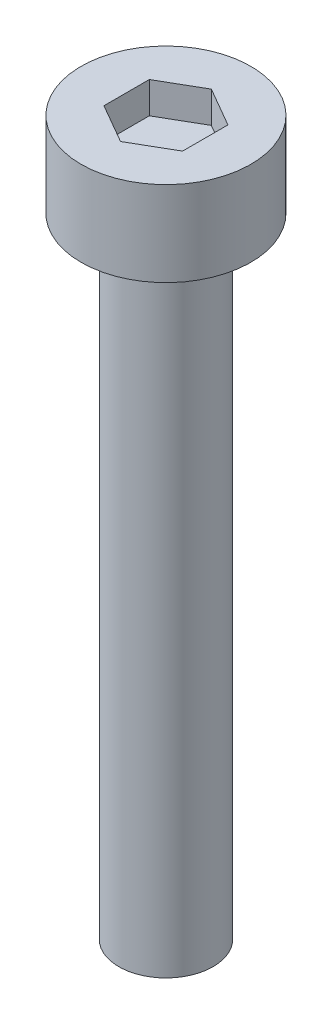
ISO-10303-21;
HEADER;
FILE_DESCRIPTION(('STEP AP214'),'2;1');
FILE_NAME('part.step','',(''),(''),'','','');
FILE_SCHEMA(('AUTOMOTIVE_DESIGN { 1 0 10303 214 1 1 1 1 }'));
ENDSEC;
DATA;
#1=APPLICATION_CONTEXT('core data for automotive mechanical design processes');
#2=APPLICATION_PROTOCOL_DEFINITION('international standard','automotive_design',2000,#1);
#3=PRODUCT_CONTEXT('',#1,'mechanical');
#4=PRODUCT('Part','Part','',(#3));
#5=PRODUCT_RELATED_PRODUCT_CATEGORY('part','',(#4));
#6=PRODUCT_DEFINITION_FORMATION('','',#4);
#7=PRODUCT_DEFINITION_CONTEXT('part definition',#1,'design');
#8=PRODUCT_DEFINITION('design','',#6,#7);
#9=PRODUCT_DEFINITION_SHAPE('','',#8);
#10=(LENGTH_UNIT() NAMED_UNIT(*) SI_UNIT(.MILLI.,.METRE.));
#11=(NAMED_UNIT(*) PLANE_ANGLE_UNIT() SI_UNIT($,.RADIAN.));
#12=(NAMED_UNIT(*) SI_UNIT($,.STERADIAN.) SOLID_ANGLE_UNIT());
#13=UNCERTAINTY_MEASURE_WITH_UNIT(LENGTH_MEASURE(1.E-05),#10,'distance_accuracy_value','');
#14=(GEOMETRIC_REPRESENTATION_CONTEXT(3) GLOBAL_UNCERTAINTY_ASSIGNED_CONTEXT((#13)) GLOBAL_UNIT_ASSIGNED_CONTEXT((#10,
#11,#12)) REPRESENTATION_CONTEXT('',''));
#15=CARTESIAN_POINT('',(0.,0.,0.));
#16=DIRECTION('',(0.,0.,1.));
#17=DIRECTION('',(1.,0.,0.));
#18=AXIS2_PLACEMENT_3D('',#15,#16,#17);
#19=CARTESIAN_POINT('',(0.,2.7,0.));
#20=DIRECTION('',(0.,-1.,0.));
#21=DIRECTION('',(0.,0.,-1.));
#22=AXIS2_PLACEMENT_3D('',#19,#20,#21);
#23=CYLINDRICAL_SURFACE('',#22,2.7);
#24=CARTESIAN_POINT('',(0.,2.7,0.));
#25=DIRECTION('',(0.,1.,0.));
#26=DIRECTION('',(0.,0.,1.));
#27=AXIS2_PLACEMENT_3D('',#24,#25,#26);
#28=CIRCLE('',#27,2.7);
#29=CARTESIAN_POINT('',(0.,2.7,2.7));
#30=VERTEX_POINT('',#29);
#31=EDGE_CURVE('E45',#30,#30,#28,.T.);
#32=ORIENTED_EDGE('',*,*,#31,.F.);
#33=EDGE_LOOP('',(#32));
#34=FACE_BOUND('',#33,.T.);
#35=CARTESIAN_POINT('',(0.,0.,0.));
#36=DIRECTION('',(0.,1.,0.));
#37=DIRECTION('',(0.,0.,1.));
#38=AXIS2_PLACEMENT_3D('',#35,#36,#37);
#39=CIRCLE('',#38,2.7);
#40=CARTESIAN_POINT('',(0.,0.,2.7));
#41=VERTEX_POINT('',#40);
#42=EDGE_CURVE('E40',#41,#41,#39,.T.);
#43=ORIENTED_EDGE('',*,*,#42,.T.);
#44=EDGE_LOOP('',(#43));
#45=FACE_BOUND('',#44,.T.);
#46=ADVANCED_FACE('F37',(#34,#45),#23,.T.);
#47=CARTESIAN_POINT('',(0.,2.7,0.));
#48=DIRECTION('',(0.,1.,0.));
#49=DIRECTION('',(0.,0.,1.));
#50=AXIS2_PLACEMENT_3D('',#47,#48,#49);
#51=PLANE('',#50);
#52=DIRECTION('',(-0.866025403784439,0.,-0.5));
#53=VECTOR('',#52,1.);
#54=CARTESIAN_POINT('',(1.25,2.7,-0.721687836487033));
#55=LINE('',#54,#53);
#56=CARTESIAN_POINT('',(1.25,2.7,-0.721687836487033));
#57=VERTEX_POINT('',#56);
#58=CARTESIAN_POINT('',(0.,2.7,-1.44337567297407));
#59=VERTEX_POINT('',#58);
#60=EDGE_CURVE('E53',#57,#59,#55,.T.);
#61=ORIENTED_EDGE('',*,*,#60,.F.);
#62=DIRECTION('',(0.,0.,-1.));
#63=VECTOR('',#62,1.);
#64=CARTESIAN_POINT('',(1.25,2.7,0.721687836487031));
#65=LINE('',#64,#63);
#66=CARTESIAN_POINT('',(1.25,2.7,0.721687836487031));
#67=VERTEX_POINT('',#66);
#68=EDGE_CURVE('E137',#67,#57,#65,.T.);
#69=ORIENTED_EDGE('',*,*,#68,.F.);
#70=DIRECTION('',(0.866025403784439,0.,-0.5));
#71=VECTOR('',#70,1.);
#72=CARTESIAN_POINT('',(0.,2.7,1.44337567297406));
#73=LINE('',#72,#71);
#74=CARTESIAN_POINT('',(0.,2.7,1.44337567297406));
#75=VERTEX_POINT('',#74);
#76=EDGE_CURVE('E135',#75,#67,#73,.T.);
#77=ORIENTED_EDGE('',*,*,#76,.F.);
#78=DIRECTION('',(0.866025403784438,0.,0.5));
#79=VECTOR('',#78,1.);
#80=CARTESIAN_POINT('',(-1.25,2.7,0.721687836487032));
#81=LINE('',#80,#79);
#82=CARTESIAN_POINT('',(-1.25,2.7,0.721687836487032));
#83=VERTEX_POINT('',#82);
#84=EDGE_CURVE('E101',#83,#75,#81,.T.);
#85=ORIENTED_EDGE('',*,*,#84,.F.);
#86=DIRECTION('',(0.,0.,1.));
#87=VECTOR('',#86,1.);
#88=CARTESIAN_POINT('',(-1.25,2.7,-0.721687836487032));
#89=LINE('',#88,#87);
#90=CARTESIAN_POINT('',(-1.25,2.7,-0.721687836487032));
#91=VERTEX_POINT('',#90);
#92=EDGE_CURVE('E131',#91,#83,#89,.T.);
#93=ORIENTED_EDGE('',*,*,#92,.F.);
#94=DIRECTION('',(-0.866025403784439,0.,0.5));
#95=VECTOR('',#94,1.);
#96=CARTESIAN_POINT('',(0.,2.7,-1.44337567297407));
#97=LINE('',#96,#95);
#98=EDGE_CURVE('E127',#59,#91,#97,.T.);
#99=ORIENTED_EDGE('',*,*,#98,.F.);
#100=EDGE_LOOP('',(#61,#69,#77,#85,#93,#99));
#101=FACE_BOUND('',#100,.T.);
#102=ORIENTED_EDGE('',*,*,#31,.T.);
#103=EDGE_LOOP('',(#102));
#104=FACE_BOUND('',#103,.T.);
#105=ADVANCED_FACE('F155',(#101,#104),#51,.T.);
#106=CARTESIAN_POINT('',(0.,0.,0.));
#107=DIRECTION('',(0.,1.,0.));
#108=DIRECTION('',(0.,0.,1.));
#109=AXIS2_PLACEMENT_3D('',#106,#107,#108);
#110=PLANE('',#109);
#111=CARTESIAN_POINT('',(0.,0.,0.));
#112=DIRECTION('',(0.,-1.,0.));
#113=DIRECTION('',(0.,0.,-1.));
#114=AXIS2_PLACEMENT_3D('',#111,#112,#113);
#115=CIRCLE('',#114,1.5);
#116=CARTESIAN_POINT('',(0.,0.,-1.5));
#117=VERTEX_POINT('',#116);
#118=EDGE_CURVE('E11',#117,#117,#115,.T.);
#119=ORIENTED_EDGE('',*,*,#118,.F.);
#120=EDGE_LOOP('',(#119));
#121=FACE_BOUND('',#120,.T.);
#122=ORIENTED_EDGE('',*,*,#42,.F.);
#123=EDGE_LOOP('',(#122));
#124=FACE_BOUND('',#123,.T.);
#125=ADVANCED_FACE('F152',(#121,#124),#110,.F.);
#126=CARTESIAN_POINT('',(1.25,1.7,-0.721687836487033));
#127=DIRECTION('',(0.5,0.,-0.866025403784439));
#128=DIRECTION('',(-0.866025403784439,0.,-0.5));
#129=AXIS2_PLACEMENT_3D('',#126,#127,#128);
#130=PLANE('',#129);
#131=ORIENTED_EDGE('',*,*,#60,.T.);
#132=DIRECTION('',(0.,1.,0.));
#133=VECTOR('',#132,1.);
#134=CARTESIAN_POINT('',(0.,1.7,-1.44337567297407));
#135=LINE('',#134,#133);
#136=CARTESIAN_POINT('',(0.,1.7,-1.44337567297407));
#137=VERTEX_POINT('',#136);
#138=EDGE_CURVE('E83',#137,#59,#135,.T.);
#139=ORIENTED_EDGE('',*,*,#138,.F.);
#140=DIRECTION('',(-0.866025403784439,0.,-0.5));
#141=VECTOR('',#140,1.);
#142=CARTESIAN_POINT('',(1.25,1.7,-0.721687836487033));
#143=LINE('',#142,#141);
#144=CARTESIAN_POINT('',(1.25,1.7,-0.721687836487033));
#145=VERTEX_POINT('',#144);
#146=EDGE_CURVE('E139',#145,#137,#143,.T.);
#147=ORIENTED_EDGE('',*,*,#146,.F.);
#148=DIRECTION('',(0.,1.,0.));
#149=VECTOR('',#148,1.);
#150=CARTESIAN_POINT('',(1.25,1.7,-0.721687836487033));
#151=LINE('',#150,#149);
#152=EDGE_CURVE('E61',#145,#57,#151,.T.);
#153=ORIENTED_EDGE('',*,*,#152,.T.);
#154=EDGE_LOOP('',(#131,#139,#147,#153));
#155=FACE_BOUND('',#154,.T.);
#156=ADVANCED_FACE('F154',(#155),#130,.F.);
#157=CARTESIAN_POINT('',(1.25,1.7,0.721687836487031));
#158=DIRECTION('',(1.,0.,0.));
#159=DIRECTION('',(0.,0.,-1.));
#160=AXIS2_PLACEMENT_3D('',#157,#158,#159);
#161=PLANE('',#160);
#162=ORIENTED_EDGE('',*,*,#68,.T.);
#163=ORIENTED_EDGE('',*,*,#152,.F.);
#164=DIRECTION('',(0.,0.,-1.));
#165=VECTOR('',#164,1.);
#166=CARTESIAN_POINT('',(1.25,1.7,0.721687836487031));
#167=LINE('',#166,#165);
#168=CARTESIAN_POINT('',(1.25,1.7,0.721687836487031));
#169=VERTEX_POINT('',#168);
#170=EDGE_CURVE('E113',#169,#145,#167,.T.);
#171=ORIENTED_EDGE('',*,*,#170,.F.);
#172=DIRECTION('',(0.,1.,0.));
#173=VECTOR('',#172,1.);
#174=CARTESIAN_POINT('',(1.25,1.7,0.721687836487031));
#175=LINE('',#174,#173);
#176=EDGE_CURVE('E105',#169,#67,#175,.T.);
#177=ORIENTED_EDGE('',*,*,#176,.T.);
#178=EDGE_LOOP('',(#162,#163,#171,#177));
#179=FACE_BOUND('',#178,.T.);
#180=ADVANCED_FACE('F161',(#179),#161,.F.);
#181=CARTESIAN_POINT('',(0.,1.7,1.44337567297406));
#182=DIRECTION('',(0.5,0.,0.866025403784439));
#183=DIRECTION('',(0.866025403784439,0.,-0.5));
#184=AXIS2_PLACEMENT_3D('',#181,#182,#183);
#185=PLANE('',#184);
#186=ORIENTED_EDGE('',*,*,#76,.T.);
#187=ORIENTED_EDGE('',*,*,#176,.F.);
#188=DIRECTION('',(0.866025403784439,0.,-0.5));
#189=VECTOR('',#188,1.);
#190=CARTESIAN_POINT('',(0.,1.7,1.44337567297406));
#191=LINE('',#190,#189);
#192=CARTESIAN_POINT('',(0.,1.7,1.44337567297406));
#193=VERTEX_POINT('',#192);
#194=EDGE_CURVE('E109',#193,#169,#191,.T.);
#195=ORIENTED_EDGE('',*,*,#194,.F.);
#196=DIRECTION('',(0.,1.,0.));
#197=VECTOR('',#196,1.);
#198=CARTESIAN_POINT('',(0.,1.7,1.44337567297406));
#199=LINE('',#198,#197);
#200=EDGE_CURVE('E94',#193,#75,#199,.T.);
#201=ORIENTED_EDGE('',*,*,#200,.T.);
#202=EDGE_LOOP('',(#186,#187,#195,#201));
#203=FACE_BOUND('',#202,.T.);
#204=ADVANCED_FACE('F110',(#203),#185,.F.);
#205=CARTESIAN_POINT('',(-1.25,1.7,0.721687836487032));
#206=DIRECTION('',(-0.5,0.,0.866025403784438));
#207=DIRECTION('',(0.866025403784438,0.,0.5));
#208=AXIS2_PLACEMENT_3D('',#205,#206,#207);
#209=PLANE('',#208);
#210=ORIENTED_EDGE('',*,*,#84,.T.);
#211=ORIENTED_EDGE('',*,*,#200,.F.);
#212=DIRECTION('',(0.866025403784438,0.,0.5));
#213=VECTOR('',#212,1.);
#214=CARTESIAN_POINT('',(-1.25,1.7,0.721687836487032));
#215=LINE('',#214,#213);
#216=CARTESIAN_POINT('',(-1.25,1.7,0.721687836487032));
#217=VERTEX_POINT('',#216);
#218=EDGE_CURVE('E98',#217,#193,#215,.T.);
#219=ORIENTED_EDGE('',*,*,#218,.F.);
#220=DIRECTION('',(0.,1.,0.));
#221=VECTOR('',#220,1.);
#222=CARTESIAN_POINT('',(-1.25,1.7,0.721687836487032));
#223=LINE('',#222,#221);
#224=EDGE_CURVE('E106',#217,#83,#223,.T.);
#225=ORIENTED_EDGE('',*,*,#224,.T.);
#226=EDGE_LOOP('',(#210,#211,#219,#225));
#227=FACE_BOUND('',#226,.T.);
#228=ADVANCED_FACE('F96',(#227),#209,.F.);
#229=CARTESIAN_POINT('',(-1.25,1.7,-0.721687836487032));
#230=DIRECTION('',(-1.,0.,0.));
#231=DIRECTION('',(0.,0.,1.));
#232=AXIS2_PLACEMENT_3D('',#229,#230,#231);
#233=PLANE('',#232);
#234=ORIENTED_EDGE('',*,*,#92,.T.);
#235=ORIENTED_EDGE('',*,*,#224,.F.);
#236=DIRECTION('',(0.,0.,1.));
#237=VECTOR('',#236,1.);
#238=CARTESIAN_POINT('',(-1.25,1.7,-0.721687836487032));
#239=LINE('',#238,#237);
#240=CARTESIAN_POINT('',(-1.25,1.7,-0.721687836487032));
#241=VERTEX_POINT('',#240);
#242=EDGE_CURVE('E119',#241,#217,#239,.T.);
#243=ORIENTED_EDGE('',*,*,#242,.F.);
#244=DIRECTION('',(0.,1.,0.));
#245=VECTOR('',#244,1.);
#246=CARTESIAN_POINT('',(-1.25,1.7,-0.721687836487032));
#247=LINE('',#246,#245);
#248=EDGE_CURVE('E143',#241,#91,#247,.T.);
#249=ORIENTED_EDGE('',*,*,#248,.T.);
#250=EDGE_LOOP('',(#234,#235,#243,#249));
#251=FACE_BOUND('',#250,.T.);
#252=ADVANCED_FACE('F210',(#251),#233,.F.);
#253=CARTESIAN_POINT('',(0.,1.7,-1.44337567297407));
#254=DIRECTION('',(-0.5,0.,-0.866025403784439));
#255=DIRECTION('',(-0.866025403784439,0.,0.5));
#256=AXIS2_PLACEMENT_3D('',#253,#254,#255);
#257=PLANE('',#256);
#258=ORIENTED_EDGE('',*,*,#98,.T.);
#259=ORIENTED_EDGE('',*,*,#248,.F.);
#260=DIRECTION('',(-0.866025403784439,0.,0.5));
#261=VECTOR('',#260,1.);
#262=CARTESIAN_POINT('',(0.,1.7,-1.44337567297407));
#263=LINE('',#262,#261);
#264=EDGE_CURVE('E121',#137,#241,#263,.T.);
#265=ORIENTED_EDGE('',*,*,#264,.F.);
#266=ORIENTED_EDGE('',*,*,#138,.T.);
#267=EDGE_LOOP('',(#258,#259,#265,#266));
#268=FACE_BOUND('',#267,.T.);
#269=ADVANCED_FACE('F220',(#268),#257,.F.);
#270=CARTESIAN_POINT('',(0.,1.7,0.));
#271=DIRECTION('',(0.,1.,0.));
#272=DIRECTION('',(0.,0.,1.));
#273=AXIS2_PLACEMENT_3D('',#270,#271,#272);
#274=PLANE('',#273);
#275=ORIENTED_EDGE('',*,*,#146,.T.);
#276=ORIENTED_EDGE('',*,*,#264,.T.);
#277=ORIENTED_EDGE('',*,*,#242,.T.);
#278=ORIENTED_EDGE('',*,*,#218,.T.);
#279=ORIENTED_EDGE('',*,*,#194,.T.);
#280=ORIENTED_EDGE('',*,*,#170,.T.);
#281=EDGE_LOOP('',(#275,#276,#277,#278,#279,#280));
#282=FACE_BOUND('',#281,.T.);
#283=ADVANCED_FACE('F116',(#282),#274,.T.);
#284=CARTESIAN_POINT('',(0.,-20.,0.));
#285=DIRECTION('',(0.,1.,0.));
#286=DIRECTION('',(0.,0.,1.));
#287=AXIS2_PLACEMENT_3D('',#284,#285,#286);
#288=CYLINDRICAL_SURFACE('',#287,1.5);
#289=CARTESIAN_POINT('',(0.,-20.,0.));
#290=DIRECTION('',(0.,-1.,0.));
#291=DIRECTION('',(0.,0.,-1.));
#292=AXIS2_PLACEMENT_3D('',#289,#290,#291);
#293=CIRCLE('',#292,1.5);
#294=CARTESIAN_POINT('',(0.,-20.,-1.5));
#295=VERTEX_POINT('',#294);
#296=EDGE_CURVE('E128',#295,#295,#293,.T.);
#297=ORIENTED_EDGE('',*,*,#296,.F.);
#298=EDGE_LOOP('',(#297));
#299=FACE_BOUND('',#298,.T.);
#300=ORIENTED_EDGE('',*,*,#118,.T.);
#301=EDGE_LOOP('',(#300));
#302=FACE_BOUND('',#301,.T.);
#303=ADVANCED_FACE('F240',(#299,#302),#288,.T.);
#304=CARTESIAN_POINT('',(0.,-20.,0.));
#305=DIRECTION('',(0.,-1.,0.));
#306=DIRECTION('',(0.,0.,-1.));
#307=AXIS2_PLACEMENT_3D('',#304,#305,#306);
#308=PLANE('',#307);
#309=ORIENTED_EDGE('',*,*,#296,.T.);
#310=EDGE_LOOP('',(#309));
#311=FACE_BOUND('',#310,.T.);
#312=ADVANCED_FACE('F255',(#311),#308,.T.);
#313=CLOSED_SHELL('',(#46,#105,#125,#156,#180,#204,#228,#252,#269,#283,#303,#312));
#314=MANIFOLD_SOLID_BREP('B2',#313);
#315=ADVANCED_BREP_SHAPE_REPRESENTATION('',(#18,#314),#14);
#316=SHAPE_DEFINITION_REPRESENTATION(#9,#315);
ENDSEC;
END-ISO-10303-21;
